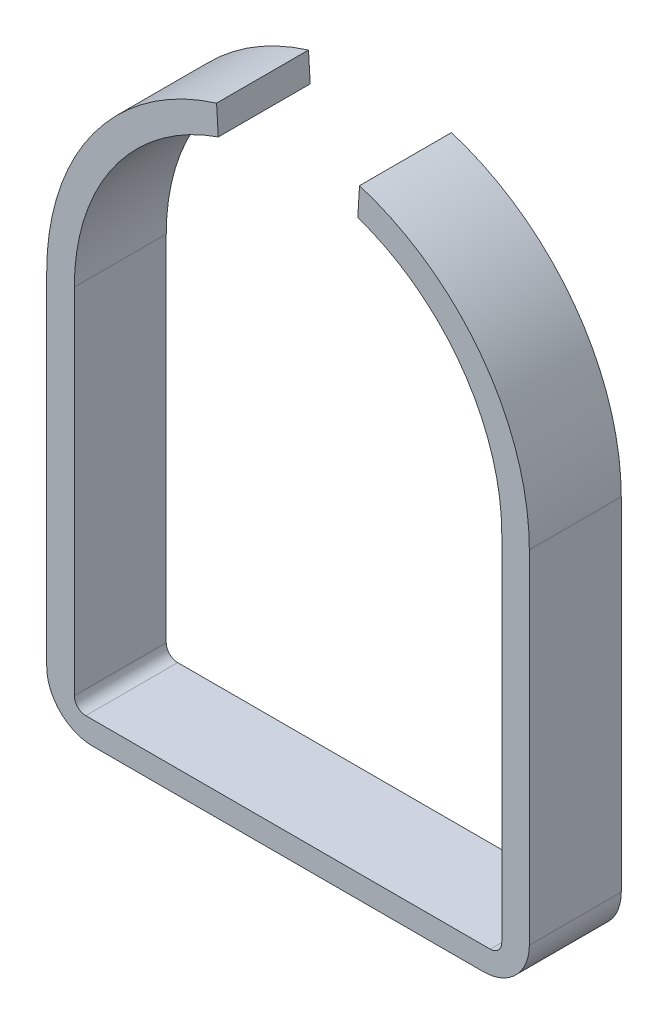
ISO-10303-21;
HEADER;
FILE_DESCRIPTION(('STEP AP214'),'2;1');
FILE_NAME('part.step','',(''),(''),'','','');
FILE_SCHEMA(('AUTOMOTIVE_DESIGN { 1 0 10303 214 1 1 1 1 }'));
ENDSEC;
DATA;
#1=APPLICATION_CONTEXT('core data for automotive mechanical design processes');
#2=APPLICATION_PROTOCOL_DEFINITION('international standard','automotive_design',2000,#1);
#3=PRODUCT_CONTEXT('',#1,'mechanical');
#4=PRODUCT('Part','Part','',(#3));
#5=PRODUCT_RELATED_PRODUCT_CATEGORY('part','',(#4));
#6=PRODUCT_DEFINITION_FORMATION('','',#4);
#7=PRODUCT_DEFINITION_CONTEXT('part definition',#1,'design');
#8=PRODUCT_DEFINITION('design','',#6,#7);
#9=PRODUCT_DEFINITION_SHAPE('','',#8);
#10=(LENGTH_UNIT() NAMED_UNIT(*) SI_UNIT(.MILLI.,.METRE.));
#11=(NAMED_UNIT(*) PLANE_ANGLE_UNIT() SI_UNIT($,.RADIAN.));
#12=(NAMED_UNIT(*) SI_UNIT($,.STERADIAN.) SOLID_ANGLE_UNIT());
#13=UNCERTAINTY_MEASURE_WITH_UNIT(LENGTH_MEASURE(1.E-05),#10,'distance_accuracy_value','');
#14=(GEOMETRIC_REPRESENTATION_CONTEXT(3) GLOBAL_UNCERTAINTY_ASSIGNED_CONTEXT((#13)) GLOBAL_UNIT_ASSIGNED_CONTEXT((#10,
#11,#12)) REPRESENTATION_CONTEXT('',''));
#15=CARTESIAN_POINT('',(0.,0.,0.));
#16=DIRECTION('',(0.,0.,1.));
#17=DIRECTION('',(1.,0.,0.));
#18=AXIS2_PLACEMENT_3D('',#15,#16,#17);
#19=CARTESIAN_POINT('',(0.,0.,56.8469714478884));
#20=DIRECTION('',(0.,0.,-1.));
#21=DIRECTION('',(-1.,0.,0.));
#22=AXIS2_PLACEMENT_3D('',#19,#20,#21);
#23=CYLINDRICAL_SURFACE('',#22,9.3);
#24=DIRECTION('',(0.,0.,-1.));
#25=VECTOR('',#24,1.);
#26=CARTESIAN_POINT('',(3.03467311666204,8.79094756411439,56.8469714478884));
#27=LINE('',#26,#25);
#28=CARTESIAN_POINT('',(3.03467311666204,8.79094756411439,1.5));
#29=VERTEX_POINT('',#28);
#30=CARTESIAN_POINT('',(3.03467311666204,8.79094756411439,5.5));
#31=VERTEX_POINT('',#30);
#32=EDGE_CURVE('E222',#29,#31,#27,.F.);
#33=ORIENTED_EDGE('',*,*,#32,.F.);
#34=CARTESIAN_POINT('',(0.,0.,1.5));
#35=DIRECTION('',(0.,0.,1.));
#36=DIRECTION('',(-1.,0.,0.));
#37=AXIS2_PLACEMENT_3D('',#34,#35,#36);
#38=CIRCLE('',#37,9.3);
#39=CARTESIAN_POINT('',(9.3,0.,1.5));
#40=VERTEX_POINT('',#39);
#41=EDGE_CURVE('E209',#40,#29,#38,.T.);
#42=ORIENTED_EDGE('',*,*,#41,.F.);
#43=DIRECTION('',(0.,0.,-1.));
#44=VECTOR('',#43,1.);
#45=CARTESIAN_POINT('',(9.3,0.,56.8469714478884));
#46=LINE('',#45,#44);
#47=CARTESIAN_POINT('',(9.3,0.,5.5));
#48=VERTEX_POINT('',#47);
#49=EDGE_CURVE('E270',#48,#40,#46,.T.);
#50=ORIENTED_EDGE('',*,*,#49,.F.);
#51=CARTESIAN_POINT('',(0.,0.,5.5));
#52=DIRECTION('',(0.,0.,1.));
#53=DIRECTION('',(1.,0.,0.));
#54=AXIS2_PLACEMENT_3D('',#51,#52,#53);
#55=CIRCLE('',#54,9.3);
#56=EDGE_CURVE('E235',#48,#31,#55,.T.);
#57=ORIENTED_EDGE('',*,*,#56,.T.);
#58=EDGE_LOOP('',(#33,#42,#50,#57));
#59=FACE_BOUND('',#58,.T.);
#60=ADVANCED_FACE('F48',(#59),#23,.F.);
#61=CARTESIAN_POINT('',(0.,0.,5.5));
#62=DIRECTION('',(0.,0.,1.));
#63=DIRECTION('',(1.,0.,0.));
#64=AXIS2_PLACEMENT_3D('',#61,#62,#63);
#65=PLANE('',#64);
#66=DIRECTION('',(0.,-1.,0.));
#67=VECTOR('',#66,1.);
#68=CARTESIAN_POINT('',(-10.5,0.,5.5));
#69=LINE('',#68,#67);
#70=CARTESIAN_POINT('',(-10.5,0.,5.5));
#71=VERTEX_POINT('',#70);
#72=CARTESIAN_POINT('',(-10.5,-14.900343897342,5.5));
#73=VERTEX_POINT('',#72);
#74=EDGE_CURVE('E178',#71,#73,#69,.T.);
#75=ORIENTED_EDGE('',*,*,#74,.T.);
#76=CARTESIAN_POINT('',(-8.5,-14.900343897342,5.5));
#77=DIRECTION('',(0.,0.,1.));
#78=DIRECTION('',(1.,0.,0.));
#79=AXIS2_PLACEMENT_3D('',#76,#77,#78);
#80=CIRCLE('',#79,2.);
#81=CARTESIAN_POINT('',(-8.5,-16.900343897342,5.5));
#82=VERTEX_POINT('',#81);
#83=EDGE_CURVE('E278',#73,#82,#80,.T.);
#84=ORIENTED_EDGE('',*,*,#83,.T.);
#85=DIRECTION('',(-1.,0.,0.));
#86=VECTOR('',#85,1.);
#87=CARTESIAN_POINT('',(-11.1726993556512,-16.900343897342,5.5));
#88=LINE('',#87,#86);
#89=CARTESIAN_POINT('',(8.5,-16.900343897342,5.5));
#90=VERTEX_POINT('',#89);
#91=EDGE_CURVE('E172',#90,#82,#88,.T.);
#92=ORIENTED_EDGE('',*,*,#91,.F.);
#93=CARTESIAN_POINT('',(8.5,-14.900343897342,5.5));
#94=DIRECTION('',(0.,0.,1.));
#95=DIRECTION('',(1.,0.,0.));
#96=AXIS2_PLACEMENT_3D('',#93,#94,#95);
#97=CIRCLE('',#96,2.);
#98=CARTESIAN_POINT('',(10.5,-14.900343897342,5.5));
#99=VERTEX_POINT('',#98);
#100=EDGE_CURVE('E276',#90,#99,#97,.T.);
#101=ORIENTED_EDGE('',*,*,#100,.T.);
#102=DIRECTION('',(0.,-1.,0.));
#103=VECTOR('',#102,1.);
#104=CARTESIAN_POINT('',(10.5,0.,5.5));
#105=LINE('',#104,#103);
#106=CARTESIAN_POINT('',(10.5,0.,5.5));
#107=VERTEX_POINT('',#106);
#108=EDGE_CURVE('E239',#107,#99,#105,.T.);
#109=ORIENTED_EDGE('',*,*,#108,.F.);
#110=CARTESIAN_POINT('',(0.,0.,5.5));
#111=DIRECTION('',(0.,0.,1.));
#112=DIRECTION('',(1.,0.,0.));
#113=AXIS2_PLACEMENT_3D('',#110,#111,#112);
#114=CIRCLE('',#113,10.5);
#115=CARTESIAN_POINT('',(3.11032664956738,10.0287520725657,5.5));
#116=VERTEX_POINT('',#115);
#117=EDGE_CURVE('E241',#116,#107,#114,.F.);
#118=ORIENTED_EDGE('',*,*,#117,.F.);
#119=DIRECTION('',(-0.0610052906976046,-0.998137442693591,0.));
#120=VECTOR('',#119,1.);
#121=CARTESIAN_POINT('',(2.48808370636675,-0.152069507960009,5.5));
#122=LINE('',#121,#120);
#123=EDGE_CURVE('E246',#116,#31,#122,.T.);
#124=ORIENTED_EDGE('',*,*,#123,.T.);
#125=ORIENTED_EDGE('',*,*,#56,.F.);
#126=DIRECTION('',(0.,1.,0.));
#127=VECTOR('',#126,1.);
#128=CARTESIAN_POINT('',(9.3,0.,5.5));
#129=LINE('',#128,#127);
#130=CARTESIAN_POINT('',(9.3,-15.4,5.5));
#131=VERTEX_POINT('',#130);
#132=EDGE_CURVE('E233',#131,#48,#129,.T.);
#133=ORIENTED_EDGE('',*,*,#132,.F.);
#134=CARTESIAN_POINT('',(8.8,-15.4,5.5));
#135=DIRECTION('',(0.,0.,1.));
#136=DIRECTION('',(1.,0.,0.));
#137=AXIS2_PLACEMENT_3D('',#134,#135,#136);
#138=CIRCLE('',#137,0.5);
#139=CARTESIAN_POINT('',(8.8,-15.9,5.5));
#140=VERTEX_POINT('',#139);
#141=EDGE_CURVE('E252',#131,#140,#138,.F.);
#142=ORIENTED_EDGE('',*,*,#141,.T.);
#143=DIRECTION('',(1.,0.,0.));
#144=VECTOR('',#143,1.);
#145=CARTESIAN_POINT('',(0.,-15.9,5.5));
#146=LINE('',#145,#144);
#147=CARTESIAN_POINT('',(-8.8,-15.9,5.5));
#148=VERTEX_POINT('',#147);
#149=EDGE_CURVE('E230',#148,#140,#146,.T.);
#150=ORIENTED_EDGE('',*,*,#149,.F.);
#151=CARTESIAN_POINT('',(-8.8,-15.4,5.5));
#152=DIRECTION('',(0.,0.,1.));
#153=DIRECTION('',(1.,0.,0.));
#154=AXIS2_PLACEMENT_3D('',#151,#152,#153);
#155=CIRCLE('',#154,0.5);
#156=CARTESIAN_POINT('',(-9.3,-15.4,5.5));
#157=VERTEX_POINT('',#156);
#158=EDGE_CURVE('E225',#148,#157,#155,.F.);
#159=ORIENTED_EDGE('',*,*,#158,.T.);
#160=DIRECTION('',(0.,-1.,0.));
#161=VECTOR('',#160,1.);
#162=CARTESIAN_POINT('',(-9.3,-15.9,5.5));
#163=LINE('',#162,#161);
#164=CARTESIAN_POINT('',(-9.3,0.,5.5));
#165=VERTEX_POINT('',#164);
#166=EDGE_CURVE('E226',#165,#157,#163,.T.);
#167=ORIENTED_EDGE('',*,*,#166,.F.);
#168=CARTESIAN_POINT('',(-3.03467311644218,8.79094756419029,5.5));
#169=VERTEX_POINT('',#168);
#170=EDGE_CURVE('E238',#169,#165,#55,.T.);
#171=ORIENTED_EDGE('',*,*,#170,.F.);
#172=DIRECTION('',(-0.0610052909139107,0.99813744268037,0.));
#173=VECTOR('',#172,1.);
#174=CARTESIAN_POINT('',(-2.48808370417207,-0.152069508367079,5.5));
#175=LINE('',#174,#173);
#176=CARTESIAN_POINT('',(-3.11032664961128,10.0287520725521,5.5));
#177=VERTEX_POINT('',#176);
#178=EDGE_CURVE('E248',#169,#177,#175,.T.);
#179=ORIENTED_EDGE('',*,*,#178,.T.);
#180=CARTESIAN_POINT('',(0.,0.,5.5));
#181=DIRECTION('',(0.,0.,1.));
#182=DIRECTION('',(1.,0.,0.));
#183=AXIS2_PLACEMENT_3D('',#180,#181,#182);
#184=CIRCLE('',#183,10.5);
#185=EDGE_CURVE('E244',#71,#177,#184,.F.);
#186=ORIENTED_EDGE('',*,*,#185,.F.);
#187=EDGE_LOOP('',(#75,#84,#92,#101,#109,#118,#124,#125,#133,#142,#150,#159,#167,#171,#179,#186));
#188=FACE_BOUND('',#187,.T.);
#189=ADVANCED_FACE('F294',(#188),#65,.T.);
#190=DIRECTION('',(0.,0.,-1.));
#191=VECTOR('',#190,1.);
#192=CARTESIAN_POINT('',(-3.03467311644218,8.79094756419029,56.8469714478884));
#193=LINE('',#192,#191);
#194=CARTESIAN_POINT('',(-3.03467311644218,8.79094756419029,1.5));
#195=VERTEX_POINT('',#194);
#196=EDGE_CURVE('E220',#169,#195,#193,.T.);
#197=ORIENTED_EDGE('',*,*,#196,.F.);
#198=ORIENTED_EDGE('',*,*,#170,.T.);
#199=DIRECTION('',(0.,0.,-1.));
#200=VECTOR('',#199,1.);
#201=CARTESIAN_POINT('',(-9.3,0.,56.8469714478884));
#202=LINE('',#201,#200);
#203=CARTESIAN_POINT('',(-9.3,0.,1.5));
#204=VERTEX_POINT('',#203);
#205=EDGE_CURVE('E182',#165,#204,#202,.T.);
#206=ORIENTED_EDGE('',*,*,#205,.T.);
#207=CARTESIAN_POINT('',(0.,0.,1.5));
#208=DIRECTION('',(0.,0.,1.));
#209=DIRECTION('',(-1.,0.,0.));
#210=AXIS2_PLACEMENT_3D('',#207,#208,#209);
#211=CIRCLE('',#210,9.3);
#212=EDGE_CURVE('E188',#195,#204,#211,.T.);
#213=ORIENTED_EDGE('',*,*,#212,.F.);
#214=EDGE_LOOP('',(#197,#198,#206,#213));
#215=FACE_BOUND('',#214,.T.);
#216=ADVANCED_FACE('F302',(#215),#23,.F.);
#217=CARTESIAN_POINT('',(-9.3,-15.9,56.8469714478884));
#218=DIRECTION('',(1.,0.,0.));
#219=DIRECTION('',(0.,0.,-1.));
#220=AXIS2_PLACEMENT_3D('',#217,#218,#219);
#221=PLANE('',#220);
#222=DIRECTION('',(0.,0.,-1.));
#223=VECTOR('',#222,1.);
#224=CARTESIAN_POINT('',(-9.3,-15.4,0.));
#225=LINE('',#224,#223);
#226=CARTESIAN_POINT('',(-9.3,-15.4,1.5));
#227=VERTEX_POINT('',#226);
#228=EDGE_CURVE('E229',#157,#227,#225,.T.);
#229=ORIENTED_EDGE('',*,*,#228,.T.);
#230=DIRECTION('',(0.,-1.,0.));
#231=VECTOR('',#230,1.);
#232=CARTESIAN_POINT('',(-9.3,0.,1.5));
#233=LINE('',#232,#231);
#234=EDGE_CURVE('E194',#204,#227,#233,.T.);
#235=ORIENTED_EDGE('',*,*,#234,.F.);
#236=ORIENTED_EDGE('',*,*,#205,.F.);
#237=ORIENTED_EDGE('',*,*,#166,.T.);
#238=EDGE_LOOP('',(#229,#235,#236,#237));
#239=FACE_BOUND('',#238,.T.);
#240=ADVANCED_FACE('F307',(#239),#221,.T.);
#241=CARTESIAN_POINT('',(0.,-15.9,56.8469714478884));
#242=DIRECTION('',(0.,1.,0.));
#243=DIRECTION('',(0.,0.,1.));
#244=AXIS2_PLACEMENT_3D('',#241,#242,#243);
#245=PLANE('',#244);
#246=DIRECTION('',(0.,0.,-1.));
#247=VECTOR('',#246,1.);
#248=CARTESIAN_POINT('',(8.8,-15.9,0.));
#249=LINE('',#248,#247);
#250=CARTESIAN_POINT('',(8.8,-15.9,1.5));
#251=VERTEX_POINT('',#250);
#252=EDGE_CURVE('E260',#140,#251,#249,.T.);
#253=ORIENTED_EDGE('',*,*,#252,.T.);
#254=DIRECTION('',(1.,0.,0.));
#255=VECTOR('',#254,1.);
#256=CARTESIAN_POINT('',(-8.8,-15.9,1.5));
#257=LINE('',#256,#255);
#258=CARTESIAN_POINT('',(-8.8,-15.9,1.5));
#259=VERTEX_POINT('',#258);
#260=EDGE_CURVE('E200',#259,#251,#257,.T.);
#261=ORIENTED_EDGE('',*,*,#260,.F.);
#262=DIRECTION('',(0.,0.,-1.));
#263=VECTOR('',#262,1.);
#264=CARTESIAN_POINT('',(-8.8,-15.9,6.02159565602451));
#265=LINE('',#264,#263);
#266=EDGE_CURVE('E262',#259,#148,#265,.F.);
#267=ORIENTED_EDGE('',*,*,#266,.T.);
#268=ORIENTED_EDGE('',*,*,#149,.T.);
#269=EDGE_LOOP('',(#253,#261,#267,#268));
#270=FACE_BOUND('',#269,.T.);
#271=ADVANCED_FACE('F314',(#270),#245,.T.);
#272=CARTESIAN_POINT('',(-8.8,-15.4,56.8469714478884));
#273=DIRECTION('',(0.,0.,1.));
#274=DIRECTION('',(1.,0.,0.));
#275=AXIS2_PLACEMENT_3D('',#272,#273,#274);
#276=CYLINDRICAL_SURFACE('',#275,0.5);
#277=ORIENTED_EDGE('',*,*,#266,.F.);
#278=CARTESIAN_POINT('',(-8.8,-15.4,1.5));
#279=DIRECTION('',(0.,0.,1.));
#280=DIRECTION('',(-1.,0.,0.));
#281=AXIS2_PLACEMENT_3D('',#278,#279,#280);
#282=CIRCLE('',#281,0.5);
#283=EDGE_CURVE('E197',#227,#259,#282,.T.);
#284=ORIENTED_EDGE('',*,*,#283,.F.);
#285=ORIENTED_EDGE('',*,*,#228,.F.);
#286=ORIENTED_EDGE('',*,*,#158,.F.);
#287=EDGE_LOOP('',(#277,#284,#285,#286));
#288=FACE_BOUND('',#287,.T.);
#289=ADVANCED_FACE('F310',(#288),#276,.F.);
#290=CARTESIAN_POINT('',(9.3,0.,56.8469714478884));
#291=DIRECTION('',(-1.,0.,0.));
#292=DIRECTION('',(0.,-1.,0.));
#293=AXIS2_PLACEMENT_3D('',#290,#291,#292);
#294=PLANE('',#293);
#295=ORIENTED_EDGE('',*,*,#49,.T.);
#296=DIRECTION('',(0.,1.,0.));
#297=VECTOR('',#296,1.);
#298=CARTESIAN_POINT('',(9.3,-15.4,1.5));
#299=LINE('',#298,#297);
#300=CARTESIAN_POINT('',(9.3,-15.4,1.5));
#301=VERTEX_POINT('',#300);
#302=EDGE_CURVE('E206',#301,#40,#299,.T.);
#303=ORIENTED_EDGE('',*,*,#302,.F.);
#304=DIRECTION('',(0.,0.,-1.));
#305=VECTOR('',#304,1.);
#306=CARTESIAN_POINT('',(9.3,-15.4,6.0215956560245));
#307=LINE('',#306,#305);
#308=EDGE_CURVE('E258',#301,#131,#307,.F.);
#309=ORIENTED_EDGE('',*,*,#308,.T.);
#310=ORIENTED_EDGE('',*,*,#132,.T.);
#311=EDGE_LOOP('',(#295,#303,#309,#310));
#312=FACE_BOUND('',#311,.T.);
#313=ADVANCED_FACE('F322',(#312),#294,.T.);
#314=CARTESIAN_POINT('',(8.8,-15.4,56.8469714478884));
#315=DIRECTION('',(0.,0.,1.));
#316=DIRECTION('',(1.,0.,0.));
#317=AXIS2_PLACEMENT_3D('',#314,#315,#316);
#318=CYLINDRICAL_SURFACE('',#317,0.5);
#319=ORIENTED_EDGE('',*,*,#308,.F.);
#320=CARTESIAN_POINT('',(8.8,-15.4,1.5));
#321=DIRECTION('',(0.,0.,1.));
#322=DIRECTION('',(-1.,0.,0.));
#323=AXIS2_PLACEMENT_3D('',#320,#321,#322);
#324=CIRCLE('',#323,0.5);
#325=EDGE_CURVE('E203',#251,#301,#324,.T.);
#326=ORIENTED_EDGE('',*,*,#325,.F.);
#327=ORIENTED_EDGE('',*,*,#252,.F.);
#328=ORIENTED_EDGE('',*,*,#141,.F.);
#329=EDGE_LOOP('',(#319,#326,#327,#328));
#330=FACE_BOUND('',#329,.T.);
#331=ADVANCED_FACE('F318',(#330),#318,.F.);
#332=CARTESIAN_POINT('',(2.48808370636675,-0.152069507960009,7.65));
#333=DIRECTION('',(0.998137442693591,-0.0610052906976046,0.));
#334=DIRECTION('',(0.0610052906976046,0.998137442693591,0.));
#335=AXIS2_PLACEMENT_3D('',#332,#333,#334);
#336=PLANE('',#335);
#337=DIRECTION('',(0.,0.,-1.));
#338=VECTOR('',#337,1.);
#339=CARTESIAN_POINT('',(3.11032664956738,10.0287520725657,7.65));
#340=LINE('',#339,#338);
#341=CARTESIAN_POINT('',(3.11032664956738,10.0287520725657,1.5));
#342=VERTEX_POINT('',#341);
#343=EDGE_CURVE('E266',#116,#342,#340,.T.);
#344=ORIENTED_EDGE('',*,*,#343,.T.);
#345=DIRECTION('',(0.0610052906976045,0.998137442693591,0.));
#346=VECTOR('',#345,1.);
#347=CARTESIAN_POINT('',(3.03467311666204,8.79094756411439,1.5));
#348=LINE('',#347,#346);
#349=EDGE_CURVE('E212',#29,#342,#348,.T.);
#350=ORIENTED_EDGE('',*,*,#349,.F.);
#351=ORIENTED_EDGE('',*,*,#32,.T.);
#352=ORIENTED_EDGE('',*,*,#123,.F.);
#353=EDGE_LOOP('',(#344,#350,#351,#352));
#354=FACE_BOUND('',#353,.T.);
#355=ADVANCED_FACE('F330',(#354),#336,.F.);
#356=CARTESIAN_POINT('',(0.,0.,7.65));
#357=DIRECTION('',(0.,0.,-1.));
#358=DIRECTION('',(-1.,0.,0.));
#359=AXIS2_PLACEMENT_3D('',#356,#357,#358);
#360=CYLINDRICAL_SURFACE('',#359,10.5);
#361=DIRECTION('',(0.,0.,-1.));
#362=VECTOR('',#361,1.);
#363=CARTESIAN_POINT('',(-3.11032664961128,10.0287520725521,7.65));
#364=LINE('',#363,#362);
#365=CARTESIAN_POINT('',(-3.11032664961128,10.0287520725521,1.5));
#366=VERTEX_POINT('',#365);
#367=EDGE_CURVE('E183',#177,#366,#364,.T.);
#368=ORIENTED_EDGE('',*,*,#367,.T.);
#369=CARTESIAN_POINT('',(0.,0.,1.5));
#370=DIRECTION('',(0.,0.,-1.));
#371=DIRECTION('',(-1.,0.,0.));
#372=AXIS2_PLACEMENT_3D('',#369,#370,#371);
#373=CIRCLE('',#372,10.5);
#374=CARTESIAN_POINT('',(-10.5,0.,1.5));
#375=VERTEX_POINT('',#374);
#376=EDGE_CURVE('E166',#375,#366,#373,.T.);
#377=ORIENTED_EDGE('',*,*,#376,.F.);
#378=DIRECTION('',(0.,0.,-1.));
#379=VECTOR('',#378,1.);
#380=CARTESIAN_POINT('',(-10.5,0.,7.65));
#381=LINE('',#380,#379);
#382=EDGE_CURVE('E175',#71,#375,#381,.T.);
#383=ORIENTED_EDGE('',*,*,#382,.F.);
#384=ORIENTED_EDGE('',*,*,#185,.T.);
#385=EDGE_LOOP('',(#368,#377,#383,#384));
#386=FACE_BOUND('',#385,.T.);
#387=ADVANCED_FACE('F185',(#386),#360,.T.);
#388=CARTESIAN_POINT('',(-10.5,0.,7.65));
#389=DIRECTION('',(1.,0.,0.));
#390=DIRECTION('',(0.,0.,-1.));
#391=AXIS2_PLACEMENT_3D('',#388,#389,#390);
#392=PLANE('',#391);
#393=DIRECTION('',(0.,1.,0.));
#394=VECTOR('',#393,1.);
#395=CARTESIAN_POINT('',(-10.5,-17.,1.5));
#396=LINE('',#395,#394);
#397=CARTESIAN_POINT('',(-10.5,-14.900343897342,1.5));
#398=VERTEX_POINT('',#397);
#399=EDGE_CURVE('E161',#398,#375,#396,.T.);
#400=ORIENTED_EDGE('',*,*,#399,.F.);
#401=DIRECTION('',(0.,0.,1.));
#402=VECTOR('',#401,1.);
#403=CARTESIAN_POINT('',(-10.5,-14.900343897342,7.65));
#404=LINE('',#403,#402);
#405=EDGE_CURVE('E274',#398,#73,#404,.T.);
#406=ORIENTED_EDGE('',*,*,#405,.T.);
#407=ORIENTED_EDGE('',*,*,#74,.F.);
#408=ORIENTED_EDGE('',*,*,#382,.T.);
#409=EDGE_LOOP('',(#400,#406,#407,#408));
#410=FACE_BOUND('',#409,.T.);
#411=ADVANCED_FACE('F176',(#410),#392,.F.);
#412=DIRECTION('',(0.,0.,-1.));
#413=VECTOR('',#412,1.);
#414=CARTESIAN_POINT('',(10.5,0.,7.65));
#415=LINE('',#414,#413);
#416=CARTESIAN_POINT('',(10.5,0.,1.5));
#417=VERTEX_POINT('',#416);
#418=EDGE_CURVE('E264',#107,#417,#415,.T.);
#419=ORIENTED_EDGE('',*,*,#418,.T.);
#420=CARTESIAN_POINT('',(0.,0.,1.5));
#421=DIRECTION('',(0.,0.,-1.));
#422=DIRECTION('',(-1.,0.,0.));
#423=AXIS2_PLACEMENT_3D('',#420,#421,#422);
#424=CIRCLE('',#423,10.5);
#425=EDGE_CURVE('E215',#342,#417,#424,.T.);
#426=ORIENTED_EDGE('',*,*,#425,.F.);
#427=ORIENTED_EDGE('',*,*,#343,.F.);
#428=ORIENTED_EDGE('',*,*,#117,.T.);
#429=EDGE_LOOP('',(#419,#426,#427,#428));
#430=FACE_BOUND('',#429,.T.);
#431=ADVANCED_FACE('F334',(#430),#360,.T.);
#432=CARTESIAN_POINT('',(10.5,0.,7.65));
#433=DIRECTION('',(1.,0.,0.));
#434=DIRECTION('',(0.,1.,0.));
#435=AXIS2_PLACEMENT_3D('',#432,#433,#434);
#436=PLANE('',#435);
#437=ORIENTED_EDGE('',*,*,#108,.T.);
#438=DIRECTION('',(0.,0.,1.));
#439=VECTOR('',#438,1.);
#440=CARTESIAN_POINT('',(10.5,-14.900343897342,1.5));
#441=LINE('',#440,#439);
#442=CARTESIAN_POINT('',(10.5,-14.900343897342,1.5));
#443=VERTEX_POINT('',#442);
#444=EDGE_CURVE('E11',#99,#443,#441,.F.);
#445=ORIENTED_EDGE('',*,*,#444,.T.);
#446=DIRECTION('',(0.,-1.,0.));
#447=VECTOR('',#446,1.);
#448=CARTESIAN_POINT('',(10.5,0.,1.5));
#449=LINE('',#448,#447);
#450=EDGE_CURVE('E218',#417,#443,#449,.T.);
#451=ORIENTED_EDGE('',*,*,#450,.F.);
#452=ORIENTED_EDGE('',*,*,#418,.F.);
#453=EDGE_LOOP('',(#437,#445,#451,#452));
#454=FACE_BOUND('',#453,.T.);
#455=ADVANCED_FACE('F336',(#454),#436,.T.);
#456=CARTESIAN_POINT('',(-2.48808370417207,-0.152069508367079,7.65));
#457=DIRECTION('',(-0.99813744268037,-0.0610052909139107,0.));
#458=DIRECTION('',(0.0610052909139107,-0.99813744268037,0.));
#459=AXIS2_PLACEMENT_3D('',#456,#457,#458);
#460=PLANE('',#459);
#461=ORIENTED_EDGE('',*,*,#178,.F.);
#462=ORIENTED_EDGE('',*,*,#196,.T.);
#463=DIRECTION('',(0.0610052909138892,-0.998137442680372,0.));
#464=VECTOR('',#463,1.);
#465=CARTESIAN_POINT('',(-3.11032664961128,10.0287520725521,1.5));
#466=LINE('',#465,#464);
#467=EDGE_CURVE('E186',#366,#195,#466,.T.);
#468=ORIENTED_EDGE('',*,*,#467,.F.);
#469=ORIENTED_EDGE('',*,*,#367,.F.);
#470=EDGE_LOOP('',(#461,#462,#468,#469));
#471=FACE_BOUND('',#470,.T.);
#472=ADVANCED_FACE('F299',(#471),#460,.F.);
#473=CARTESIAN_POINT('',(9.35000000018532,-17.0923044276493,1.5));
#474=DIRECTION('',(0.,0.,-1.));
#475=DIRECTION('',(-1.,0.,0.));
#476=AXIS2_PLACEMENT_3D('',#473,#474,#475);
#477=PLANE('',#476);
#478=DIRECTION('',(1.,0.,0.));
#479=VECTOR('',#478,1.);
#480=CARTESIAN_POINT('',(9.35000000018532,-16.900343897342,1.5));
#481=LINE('',#480,#479);
#482=CARTESIAN_POINT('',(-8.5,-16.900343897342,1.5));
#483=VERTEX_POINT('',#482);
#484=CARTESIAN_POINT('',(8.5,-16.900343897342,1.5));
#485=VERTEX_POINT('',#484);
#486=EDGE_CURVE('E272',#483,#485,#481,.T.);
#487=ORIENTED_EDGE('',*,*,#486,.F.);
#488=CARTESIAN_POINT('',(-8.5,-14.900343897342,1.5));
#489=DIRECTION('',(0.,0.,-1.));
#490=DIRECTION('',(-1.,0.,0.));
#491=AXIS2_PLACEMENT_3D('',#488,#489,#490);
#492=CIRCLE('',#491,2.);
#493=EDGE_CURVE('E56',#483,#398,#492,.T.);
#494=ORIENTED_EDGE('',*,*,#493,.T.);
#495=ORIENTED_EDGE('',*,*,#399,.T.);
#496=ORIENTED_EDGE('',*,*,#376,.T.);
#497=ORIENTED_EDGE('',*,*,#467,.T.);
#498=ORIENTED_EDGE('',*,*,#212,.T.);
#499=ORIENTED_EDGE('',*,*,#234,.T.);
#500=ORIENTED_EDGE('',*,*,#283,.T.);
#501=ORIENTED_EDGE('',*,*,#260,.T.);
#502=ORIENTED_EDGE('',*,*,#325,.T.);
#503=ORIENTED_EDGE('',*,*,#302,.T.);
#504=ORIENTED_EDGE('',*,*,#41,.T.);
#505=ORIENTED_EDGE('',*,*,#349,.T.);
#506=ORIENTED_EDGE('',*,*,#425,.T.);
#507=ORIENTED_EDGE('',*,*,#450,.T.);
#508=CARTESIAN_POINT('',(8.5,-14.900343897342,1.5));
#509=DIRECTION('',(0.,0.,-1.));
#510=DIRECTION('',(-1.,0.,0.));
#511=AXIS2_PLACEMENT_3D('',#508,#509,#510);
#512=CIRCLE('',#511,2.);
#513=EDGE_CURVE('E68',#443,#485,#512,.T.);
#514=ORIENTED_EDGE('',*,*,#513,.T.);
#515=EDGE_LOOP('',(#487,#494,#495,#496,#497,#498,#499,#500,#501,#502,#503,#504,#505,#506,#507,#514));
#516=FACE_BOUND('',#515,.T.);
#517=ADVANCED_FACE('F163',(#516),#477,.T.);
#518=CARTESIAN_POINT('',(-11.1726993556512,-16.900343897342,-4.5));
#519=DIRECTION('',(0.,1.,0.));
#520=DIRECTION('',(0.,0.,1.));
#521=AXIS2_PLACEMENT_3D('',#518,#519,#520);
#522=PLANE('',#521);
#523=ORIENTED_EDGE('',*,*,#91,.T.);
#524=DIRECTION('',(0.,0.,1.));
#525=VECTOR('',#524,1.);
#526=CARTESIAN_POINT('',(-8.5,-16.900343897342,-4.5));
#527=LINE('',#526,#525);
#528=EDGE_CURVE('E283',#82,#483,#527,.F.);
#529=ORIENTED_EDGE('',*,*,#528,.T.);
#530=ORIENTED_EDGE('',*,*,#486,.T.);
#531=DIRECTION('',(0.,0.,1.));
#532=VECTOR('',#531,1.);
#533=CARTESIAN_POINT('',(8.5,-16.900343897342,5.5));
#534=LINE('',#533,#532);
#535=EDGE_CURVE('E280',#485,#90,#534,.T.);
#536=ORIENTED_EDGE('',*,*,#535,.T.);
#537=EDGE_LOOP('',(#523,#529,#530,#536));
#538=FACE_BOUND('',#537,.T.);
#539=ADVANCED_FACE('F288',(#538),#522,.F.);
#540=CARTESIAN_POINT('',(-8.5,-14.900343897342,7.65));
#541=DIRECTION('',(0.,0.,1.));
#542=DIRECTION('',(1.,0.,0.));
#543=AXIS2_PLACEMENT_3D('',#540,#541,#542);
#544=CYLINDRICAL_SURFACE('',#543,2.);
#545=ORIENTED_EDGE('',*,*,#493,.F.);
#546=ORIENTED_EDGE('',*,*,#528,.F.);
#547=ORIENTED_EDGE('',*,*,#83,.F.);
#548=ORIENTED_EDGE('',*,*,#405,.F.);
#549=EDGE_LOOP('',(#545,#546,#547,#548));
#550=FACE_BOUND('',#549,.T.);
#551=ADVANCED_FACE('F292',(#550),#544,.T.);
#552=CARTESIAN_POINT('',(8.5,-14.900343897342,-4.5));
#553=DIRECTION('',(0.,0.,-1.));
#554=DIRECTION('',(-1.,0.,0.));
#555=AXIS2_PLACEMENT_3D('',#552,#553,#554);
#556=CYLINDRICAL_SURFACE('',#555,2.);
#557=ORIENTED_EDGE('',*,*,#513,.F.);
#558=ORIENTED_EDGE('',*,*,#444,.F.);
#559=ORIENTED_EDGE('',*,*,#100,.F.);
#560=ORIENTED_EDGE('',*,*,#535,.F.);
#561=EDGE_LOOP('',(#557,#558,#559,#560));
#562=FACE_BOUND('',#561,.T.);
#563=ADVANCED_FACE('F50',(#562),#556,.T.);
#564=CLOSED_SHELL('',(#60,#189,#216,#240,#271,#289,#313,#331,#355,#387,#411,#431,#455,#472,#517,
#539,#551,#563));
#565=MANIFOLD_SOLID_BREP('B2',#564);
#566=ADVANCED_BREP_SHAPE_REPRESENTATION('',(#18,#565),#14);
#567=SHAPE_DEFINITION_REPRESENTATION(#9,#566);
ENDSEC;
END-ISO-10303-21;
